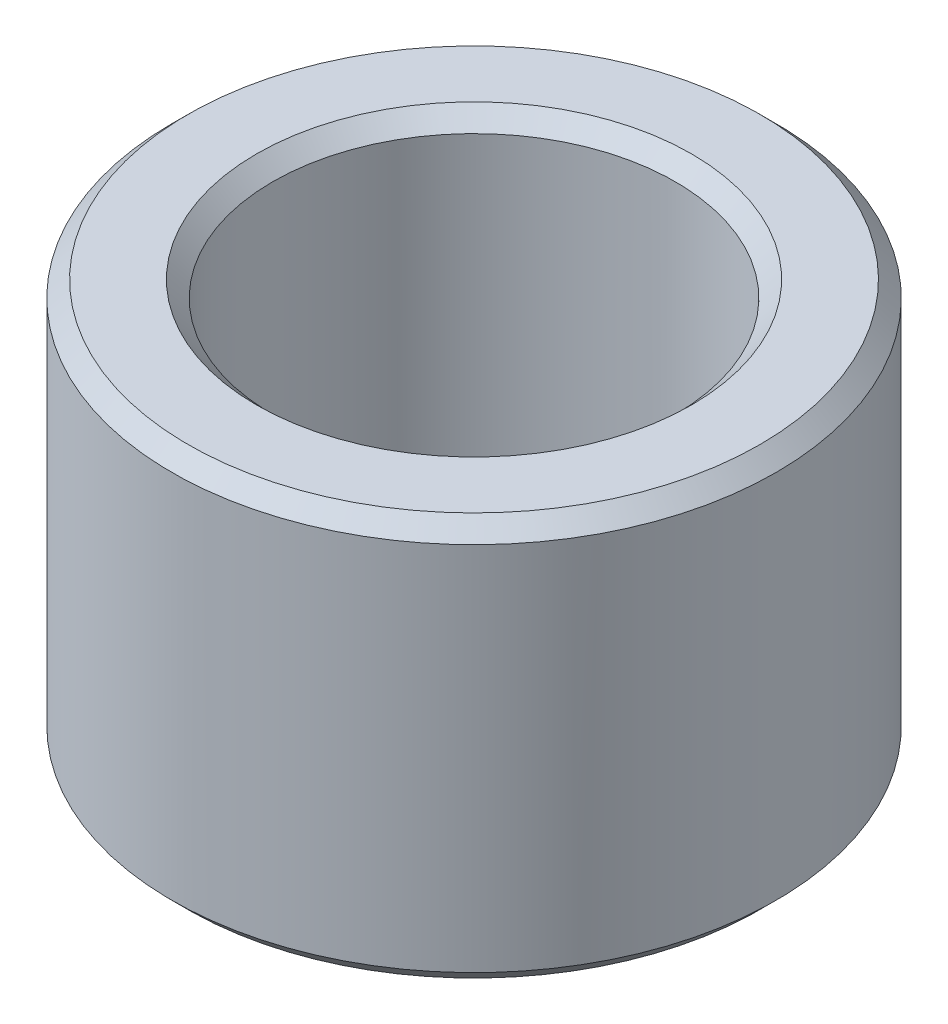
ISO-10303-21;
HEADER;
FILE_DESCRIPTION(('STEP AP214'),'2;1');
FILE_NAME('part.step','',(''),(''),'','','');
FILE_SCHEMA(('AUTOMOTIVE_DESIGN { 1 0 10303 214 1 1 1 1 }'));
ENDSEC;
DATA;
#1=APPLICATION_CONTEXT('core data for automotive mechanical design processes');
#2=APPLICATION_PROTOCOL_DEFINITION('international standard','automotive_design',2000,#1);
#3=PRODUCT_CONTEXT('',#1,'mechanical');
#4=PRODUCT('Part','Part','',(#3));
#5=PRODUCT_RELATED_PRODUCT_CATEGORY('part','',(#4));
#6=PRODUCT_DEFINITION_FORMATION('','',#4);
#7=PRODUCT_DEFINITION_CONTEXT('part definition',#1,'design');
#8=PRODUCT_DEFINITION('design','',#6,#7);
#9=PRODUCT_DEFINITION_SHAPE('','',#8);
#10=(LENGTH_UNIT() NAMED_UNIT(*) SI_UNIT(.MILLI.,.METRE.));
#11=(NAMED_UNIT(*) PLANE_ANGLE_UNIT() SI_UNIT($,.RADIAN.));
#12=(NAMED_UNIT(*) SI_UNIT($,.STERADIAN.) SOLID_ANGLE_UNIT());
#13=UNCERTAINTY_MEASURE_WITH_UNIT(LENGTH_MEASURE(1.E-05),#10,'distance_accuracy_value','');
#14=(GEOMETRIC_REPRESENTATION_CONTEXT(3) GLOBAL_UNCERTAINTY_ASSIGNED_CONTEXT((#13)) GLOBAL_UNIT_ASSIGNED_CONTEXT((#10,
#11,#12)) REPRESENTATION_CONTEXT('',''));
#15=CARTESIAN_POINT('',(0.,0.,0.));
#16=DIRECTION('',(0.,0.,1.));
#17=DIRECTION('',(1.,0.,0.));
#18=AXIS2_PLACEMENT_3D('',#15,#16,#17);
#19=CARTESIAN_POINT('',(4.7625,3.175,0.));
#20=DIRECTION('',(0.,-1.,0.));
#21=DIRECTION('',(1.,0.,0.));
#22=AXIS2_PLACEMENT_3D('',#19,#20,#21);
#23=PLANE('',#22);
#24=CARTESIAN_POINT('',(0.,3.175,0.));
#25=DIRECTION('',(0.,-1.,0.));
#26=DIRECTION('',(1.,0.,0.));
#27=AXIS2_PLACEMENT_3D('',#24,#25,#26);
#28=CIRCLE('',#27,4.5085);
#29=CARTESIAN_POINT('',(4.5085,3.175,0.));
#30=VERTEX_POINT('',#29);
#31=EDGE_CURVE('E10',#30,#30,#28,.F.);
#32=ORIENTED_EDGE('',*,*,#31,.T.);
#33=EDGE_LOOP('',(#32));
#34=FACE_BOUND('',#33,.T.);
#35=CARTESIAN_POINT('',(0.,3.175,0.));
#36=DIRECTION('',(0.,-1.,0.));
#37=DIRECTION('',(1.,0.,0.));
#38=AXIS2_PLACEMENT_3D('',#35,#36,#37);
#39=CIRCLE('',#38,3.429);
#40=CARTESIAN_POINT('',(3.429,3.175,0.));
#41=VERTEX_POINT('',#40);
#42=EDGE_CURVE('E37',#41,#41,#39,.T.);
#43=ORIENTED_EDGE('',*,*,#42,.T.);
#44=EDGE_LOOP('',(#43));
#45=FACE_BOUND('',#44,.T.);
#46=ADVANCED_FACE('F30',(#34,#45),#23,.F.);
#47=CARTESIAN_POINT('',(0.,2.82264395586689,0.));
#48=DIRECTION('',(0.,1.,0.));
#49=DIRECTION('',(-1.,0.,0.));
#50=AXIS2_PLACEMENT_3D('',#47,#48,#49);
#51=CYLINDRICAL_SURFACE('',#50,3.175);
#52=CARTESIAN_POINT('',(0.,-2.921,0.));
#53=DIRECTION('',(0.,1.,0.));
#54=DIRECTION('',(-1.,0.,0.));
#55=AXIS2_PLACEMENT_3D('',#52,#53,#54);
#56=CIRCLE('',#55,3.175);
#57=CARTESIAN_POINT('',(-3.175,-2.921,0.));
#58=VERTEX_POINT('',#57);
#59=EDGE_CURVE('E50',#58,#58,#56,.F.);
#60=ORIENTED_EDGE('',*,*,#59,.T.);
#61=EDGE_LOOP('',(#60));
#62=FACE_BOUND('',#61,.T.);
#63=CARTESIAN_POINT('',(0.,2.921,0.));
#64=DIRECTION('',(0.,-1.,0.));
#65=DIRECTION('',(1.,0.,0.));
#66=AXIS2_PLACEMENT_3D('',#63,#64,#65);
#67=CIRCLE('',#66,3.175);
#68=CARTESIAN_POINT('',(3.175,2.921,0.));
#69=VERTEX_POINT('',#68);
#70=EDGE_CURVE('E53',#69,#69,#67,.F.);
#71=ORIENTED_EDGE('',*,*,#70,.T.);
#72=EDGE_LOOP('',(#71));
#73=FACE_BOUND('',#72,.T.);
#74=ADVANCED_FACE('F86',(#62,#73),#51,.F.);
#75=CARTESIAN_POINT('',(3.175,-3.175,0.));
#76=DIRECTION('',(0.,1.,0.));
#77=DIRECTION('',(-1.,0.,0.));
#78=AXIS2_PLACEMENT_3D('',#75,#76,#77);
#79=PLANE('',#78);
#80=CARTESIAN_POINT('',(0.,-3.175,0.));
#81=DIRECTION('',(0.,1.,0.));
#82=DIRECTION('',(-1.,0.,0.));
#83=AXIS2_PLACEMENT_3D('',#80,#81,#82);
#84=CIRCLE('',#83,3.429);
#85=CARTESIAN_POINT('',(-3.429,-3.175,0.));
#86=VERTEX_POINT('',#85);
#87=EDGE_CURVE('E56',#86,#86,#84,.T.);
#88=ORIENTED_EDGE('',*,*,#87,.T.);
#89=EDGE_LOOP('',(#88));
#90=FACE_BOUND('',#89,.T.);
#91=CARTESIAN_POINT('',(0.,-3.175,0.));
#92=DIRECTION('',(0.,1.,0.));
#93=DIRECTION('',(-1.,0.,0.));
#94=AXIS2_PLACEMENT_3D('',#91,#92,#93);
#95=CIRCLE('',#94,4.5085);
#96=CARTESIAN_POINT('',(-4.5085,-3.175,0.));
#97=VERTEX_POINT('',#96);
#98=EDGE_CURVE('E59',#97,#97,#95,.F.);
#99=ORIENTED_EDGE('',*,*,#98,.T.);
#100=EDGE_LOOP('',(#99));
#101=FACE_BOUND('',#100,.T.);
#102=ADVANCED_FACE('F63',(#90,#101),#79,.F.);
#103=CARTESIAN_POINT('',(0.,2.82264395586689,0.));
#104=DIRECTION('',(0.,1.,0.));
#105=DIRECTION('',(-1.,0.,0.));
#106=AXIS2_PLACEMENT_3D('',#103,#104,#105);
#107=CYLINDRICAL_SURFACE('',#106,4.7625);
#108=CARTESIAN_POINT('',(0.,-2.921,0.));
#109=DIRECTION('',(0.,1.,0.));
#110=DIRECTION('',(-1.,0.,0.));
#111=AXIS2_PLACEMENT_3D('',#108,#109,#110);
#112=CIRCLE('',#111,4.7625);
#113=CARTESIAN_POINT('',(-4.7625,-2.921,0.));
#114=VERTEX_POINT('',#113);
#115=EDGE_CURVE('E41',#114,#114,#112,.T.);
#116=ORIENTED_EDGE('',*,*,#115,.T.);
#117=EDGE_LOOP('',(#116));
#118=FACE_BOUND('',#117,.T.);
#119=CARTESIAN_POINT('',(0.,2.921,0.));
#120=DIRECTION('',(0.,-1.,0.));
#121=DIRECTION('',(1.,0.,0.));
#122=AXIS2_PLACEMENT_3D('',#119,#120,#121);
#123=CIRCLE('',#122,4.7625);
#124=CARTESIAN_POINT('',(4.7625,2.921,0.));
#125=VERTEX_POINT('',#124);
#126=EDGE_CURVE('E45',#125,#125,#123,.T.);
#127=ORIENTED_EDGE('',*,*,#126,.T.);
#128=EDGE_LOOP('',(#127));
#129=FACE_BOUND('',#128,.T.);
#130=ADVANCED_FACE('F73',(#118,#129),#107,.T.);
#131=CARTESIAN_POINT('',(0.,-3.175,0.));
#132=DIRECTION('',(0.,-1.,0.));
#133=DIRECTION('',(1.,0.,0.));
#134=AXIS2_PLACEMENT_3D('',#131,#132,#133);
#135=CONICAL_SURFACE('',#134,3.429,0.785398163397445);
#136=ORIENTED_EDGE('',*,*,#59,.F.);
#137=EDGE_LOOP('',(#136));
#138=FACE_BOUND('',#137,.T.);
#139=ORIENTED_EDGE('',*,*,#87,.F.);
#140=EDGE_LOOP('',(#139));
#141=FACE_BOUND('',#140,.T.);
#142=ADVANCED_FACE('F69',(#138,#141),#135,.F.);
#143=CARTESIAN_POINT('',(0.,-2.921,0.));
#144=DIRECTION('',(0.,1.,0.));
#145=DIRECTION('',(-1.,0.,0.));
#146=AXIS2_PLACEMENT_3D('',#143,#144,#145);
#147=CONICAL_SURFACE('',#146,4.7625,0.78539816339745);
#148=ORIENTED_EDGE('',*,*,#98,.F.);
#149=EDGE_LOOP('',(#148));
#150=FACE_BOUND('',#149,.T.);
#151=ORIENTED_EDGE('',*,*,#115,.F.);
#152=EDGE_LOOP('',(#151));
#153=FACE_BOUND('',#152,.T.);
#154=ADVANCED_FACE('F65',(#150,#153),#147,.T.);
#155=CARTESIAN_POINT('',(0.,3.175,0.));
#156=DIRECTION('',(0.,-1.,0.));
#157=DIRECTION('',(1.,0.,0.));
#158=AXIS2_PLACEMENT_3D('',#155,#156,#157);
#159=CONICAL_SURFACE('',#158,4.5085,0.78539816339745);
#160=ORIENTED_EDGE('',*,*,#126,.F.);
#161=EDGE_LOOP('',(#160));
#162=FACE_BOUND('',#161,.T.);
#163=ORIENTED_EDGE('',*,*,#31,.F.);
#164=EDGE_LOOP('',(#163));
#165=FACE_BOUND('',#164,.T.);
#166=ADVANCED_FACE('F68',(#162,#165),#159,.T.);
#167=CARTESIAN_POINT('',(0.,2.921,0.));
#168=DIRECTION('',(0.,1.,0.));
#169=DIRECTION('',(-1.,0.,0.));
#170=AXIS2_PLACEMENT_3D('',#167,#168,#169);
#171=CONICAL_SURFACE('',#170,3.175,0.785398163397451);
#172=ORIENTED_EDGE('',*,*,#42,.F.);
#173=EDGE_LOOP('',(#172));
#174=FACE_BOUND('',#173,.T.);
#175=ORIENTED_EDGE('',*,*,#70,.F.);
#176=EDGE_LOOP('',(#175));
#177=FACE_BOUND('',#176,.T.);
#178=ADVANCED_FACE('F32',(#174,#177),#171,.F.);
#179=CLOSED_SHELL('',(#46,#74,#102,#130,#142,#154,#166,#178));
#180=MANIFOLD_SOLID_BREP('B2',#179);
#181=ADVANCED_BREP_SHAPE_REPRESENTATION('',(#18,#180),#14);
#182=SHAPE_DEFINITION_REPRESENTATION(#9,#181);
ENDSEC;
END-ISO-10303-21;
